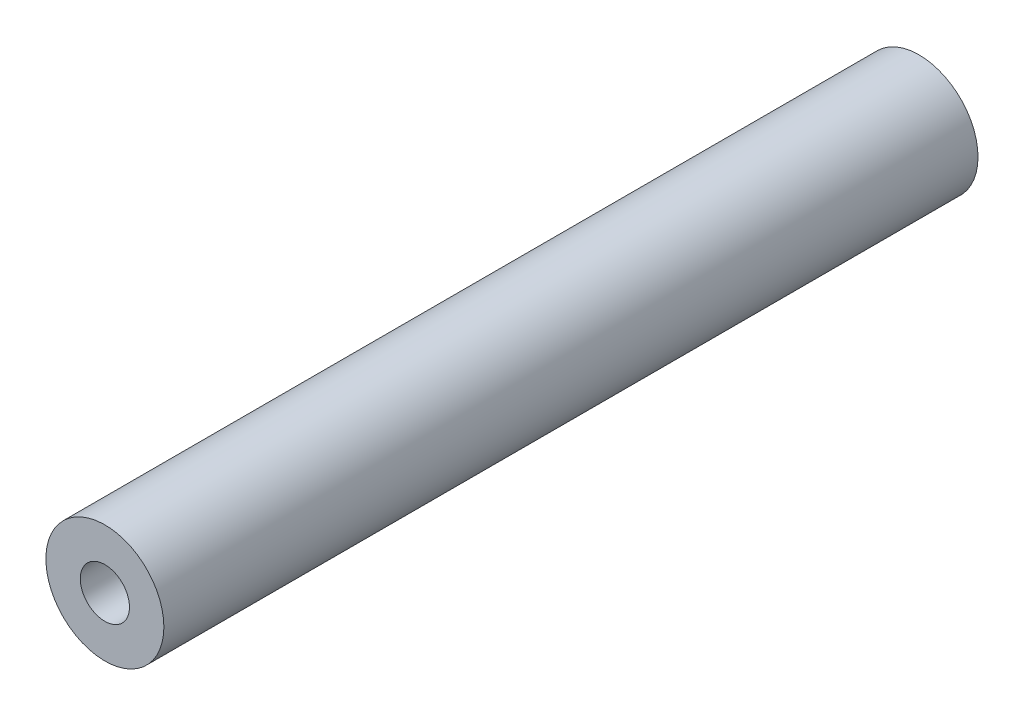
ISO-10303-21;
HEADER;
FILE_DESCRIPTION(('STEP AP214'),'2;1');
FILE_NAME('part.step','',(''),(''),'','','');
FILE_SCHEMA(('AUTOMOTIVE_DESIGN { 1 0 10303 214 1 1 1 1 }'));
ENDSEC;
DATA;
#1=APPLICATION_CONTEXT('core data for automotive mechanical design processes');
#2=APPLICATION_PROTOCOL_DEFINITION('international standard','automotive_design',2000,#1);
#3=PRODUCT_CONTEXT('',#1,'mechanical');
#4=PRODUCT('Part','Part','',(#3));
#5=PRODUCT_RELATED_PRODUCT_CATEGORY('part','',(#4));
#6=PRODUCT_DEFINITION_FORMATION('','',#4);
#7=PRODUCT_DEFINITION_CONTEXT('part definition',#1,'design');
#8=PRODUCT_DEFINITION('design','',#6,#7);
#9=PRODUCT_DEFINITION_SHAPE('','',#8);
#10=(LENGTH_UNIT() NAMED_UNIT(*) SI_UNIT(.MILLI.,.METRE.));
#11=(NAMED_UNIT(*) PLANE_ANGLE_UNIT() SI_UNIT($,.RADIAN.));
#12=(NAMED_UNIT(*) SI_UNIT($,.STERADIAN.) SOLID_ANGLE_UNIT());
#13=UNCERTAINTY_MEASURE_WITH_UNIT(LENGTH_MEASURE(1.E-05),#10,'distance_accuracy_value','');
#14=(GEOMETRIC_REPRESENTATION_CONTEXT(3) GLOBAL_UNCERTAINTY_ASSIGNED_CONTEXT((#13)) GLOBAL_UNIT_ASSIGNED_CONTEXT((#10,
#11,#12)) REPRESENTATION_CONTEXT('',''));
#15=CARTESIAN_POINT('',(0.,0.,0.));
#16=DIRECTION('',(0.,0.,1.));
#17=DIRECTION('',(1.,0.,0.));
#18=AXIS2_PLACEMENT_3D('',#15,#16,#17);
#19=CARTESIAN_POINT('',(0.,0.,41.4));
#20=DIRECTION('',(0.,0.,-1.));
#21=DIRECTION('',(-1.,0.,0.));
#22=AXIS2_PLACEMENT_3D('',#19,#20,#21);
#23=CYLINDRICAL_SURFACE('',#22,3.);
#24=CARTESIAN_POINT('',(0.,0.,41.4));
#25=DIRECTION('',(0.,0.,1.));
#26=DIRECTION('',(1.,0.,0.));
#27=AXIS2_PLACEMENT_3D('',#24,#25,#26);
#28=CIRCLE('',#27,3.);
#29=CARTESIAN_POINT('',(3.,0.,41.4));
#30=VERTEX_POINT('',#29);
#31=EDGE_CURVE('E10',#30,#30,#28,.T.);
#32=ORIENTED_EDGE('',*,*,#31,.F.);
#33=EDGE_LOOP('',(#32));
#34=FACE_BOUND('',#33,.T.);
#35=CARTESIAN_POINT('',(0.,0.,0.));
#36=DIRECTION('',(0.,0.,1.));
#37=DIRECTION('',(1.,0.,0.));
#38=AXIS2_PLACEMENT_3D('',#35,#36,#37);
#39=CIRCLE('',#38,3.);
#40=CARTESIAN_POINT('',(3.,0.,0.));
#41=VERTEX_POINT('',#40);
#42=EDGE_CURVE('E35',#41,#41,#39,.T.);
#43=ORIENTED_EDGE('',*,*,#42,.T.);
#44=EDGE_LOOP('',(#43));
#45=FACE_BOUND('',#44,.T.);
#46=ADVANCED_FACE('F32',(#34,#45),#23,.T.);
#47=CARTESIAN_POINT('',(0.,0.,41.4));
#48=DIRECTION('',(0.,0.,1.));
#49=DIRECTION('',(1.,0.,0.));
#50=AXIS2_PLACEMENT_3D('',#47,#48,#49);
#51=PLANE('',#50);
#52=CARTESIAN_POINT('',(0.,0.,41.4));
#53=DIRECTION('',(0.,0.,1.));
#54=DIRECTION('',(1.,0.,0.));
#55=AXIS2_PLACEMENT_3D('',#52,#53,#54);
#56=CIRCLE('',#55,1.25);
#57=CARTESIAN_POINT('',(1.25,0.,41.4));
#58=VERTEX_POINT('',#57);
#59=EDGE_CURVE('E44',#58,#58,#56,.T.);
#60=ORIENTED_EDGE('',*,*,#59,.F.);
#61=EDGE_LOOP('',(#60));
#62=FACE_BOUND('',#61,.T.);
#63=ORIENTED_EDGE('',*,*,#31,.T.);
#64=EDGE_LOOP('',(#63));
#65=FACE_BOUND('',#64,.T.);
#66=ADVANCED_FACE('F59',(#62,#65),#51,.T.);
#67=CARTESIAN_POINT('',(0.,0.,0.));
#68=DIRECTION('',(0.,0.,1.));
#69=DIRECTION('',(1.,0.,0.));
#70=AXIS2_PLACEMENT_3D('',#67,#68,#69);
#71=PLANE('',#70);
#72=CARTESIAN_POINT('',(0.,0.,0.));
#73=DIRECTION('',(0.,0.,1.));
#74=DIRECTION('',(1.,0.,0.));
#75=AXIS2_PLACEMENT_3D('',#72,#73,#74);
#76=CIRCLE('',#75,1.25);
#77=CARTESIAN_POINT('',(1.25,0.,0.));
#78=VERTEX_POINT('',#77);
#79=EDGE_CURVE('E42',#78,#78,#76,.T.);
#80=ORIENTED_EDGE('',*,*,#79,.T.);
#81=EDGE_LOOP('',(#80));
#82=FACE_BOUND('',#81,.T.);
#83=ORIENTED_EDGE('',*,*,#42,.F.);
#84=EDGE_LOOP('',(#83));
#85=FACE_BOUND('',#84,.T.);
#86=ADVANCED_FACE('F50',(#82,#85),#71,.F.);
#87=CARTESIAN_POINT('',(0.,0.,0.));
#88=DIRECTION('',(0.,0.,1.));
#89=DIRECTION('',(1.,0.,0.));
#90=AXIS2_PLACEMENT_3D('',#87,#88,#89);
#91=CYLINDRICAL_SURFACE('',#90,1.25);
#92=ORIENTED_EDGE('',*,*,#79,.F.);
#93=EDGE_LOOP('',(#92));
#94=FACE_BOUND('',#93,.T.);
#95=ORIENTED_EDGE('',*,*,#59,.T.);
#96=EDGE_LOOP('',(#95));
#97=FACE_BOUND('',#96,.T.);
#98=ADVANCED_FACE('F53',(#94,#97),#91,.F.);
#99=CLOSED_SHELL('',(#46,#66,#86,#98));
#100=MANIFOLD_SOLID_BREP('B2',#99);
#101=ADVANCED_BREP_SHAPE_REPRESENTATION('',(#18,#100),#14);
#102=SHAPE_DEFINITION_REPRESENTATION(#9,#101);
ENDSEC;
END-ISO-10303-21;
